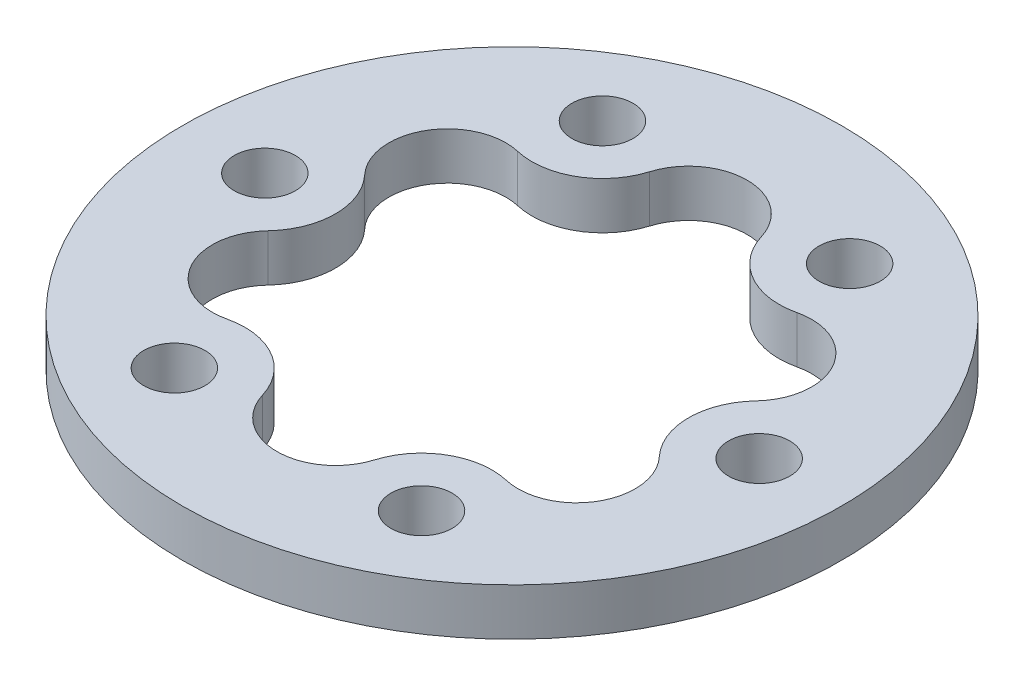
ISO-10303-21;
HEADER;
FILE_DESCRIPTION(('STEP AP214'),'2;1');
FILE_NAME('part.step','',(''),(''),'','','');
FILE_SCHEMA(('AUTOMOTIVE_DESIGN { 1 0 10303 214 1 1 1 1 }'));
ENDSEC;
DATA;
#1=APPLICATION_CONTEXT('core data for automotive mechanical design processes');
#2=APPLICATION_PROTOCOL_DEFINITION('international standard','automotive_design',2000,#1);
#3=PRODUCT_CONTEXT('',#1,'mechanical');
#4=PRODUCT('Part','Part','',(#3));
#5=PRODUCT_RELATED_PRODUCT_CATEGORY('part','',(#4));
#6=PRODUCT_DEFINITION_FORMATION('','',#4);
#7=PRODUCT_DEFINITION_CONTEXT('part definition',#1,'design');
#8=PRODUCT_DEFINITION('design','',#6,#7);
#9=PRODUCT_DEFINITION_SHAPE('','',#8);
#10=(LENGTH_UNIT() NAMED_UNIT(*) SI_UNIT(.MILLI.,.METRE.));
#11=(NAMED_UNIT(*) PLANE_ANGLE_UNIT() SI_UNIT($,.RADIAN.));
#12=(NAMED_UNIT(*) SI_UNIT($,.STERADIAN.) SOLID_ANGLE_UNIT());
#13=UNCERTAINTY_MEASURE_WITH_UNIT(LENGTH_MEASURE(1.E-05),#10,'distance_accuracy_value','');
#14=(GEOMETRIC_REPRESENTATION_CONTEXT(3) GLOBAL_UNCERTAINTY_ASSIGNED_CONTEXT((#13)) GLOBAL_UNIT_ASSIGNED_CONTEXT((#10,
#11,#12)) REPRESENTATION_CONTEXT('',''));
#15=CARTESIAN_POINT('',(0.,0.,0.));
#16=DIRECTION('',(0.,0.,1.));
#17=DIRECTION('',(1.,0.,0.));
#18=AXIS2_PLACEMENT_3D('',#15,#16,#17);
#19=CARTESIAN_POINT('',(0.,4.,0.));
#20=DIRECTION('',(0.,1.,0.));
#21=DIRECTION('',(0.,0.,-1.));
#22=AXIS2_PLACEMENT_3D('',#19,#20,#21);
#23=PLANE('',#22);
#24=CARTESIAN_POINT('',(-10.5000000000001,4.,18.1865334794733));
#25=DIRECTION('',(0.,-1.,0.));
#26=DIRECTION('',(0.,0.,-1.));
#27=AXIS2_PLACEMENT_3D('',#24,#25,#26);
#28=CIRCLE('',#27,2.6);
#29=CARTESIAN_POINT('',(-10.5000000000001,4.,15.5865334794733));
#30=VERTEX_POINT('',#29);
#31=EDGE_CURVE('E227',#30,#30,#28,.T.);
#32=ORIENTED_EDGE('',*,*,#31,.T.);
#33=EDGE_LOOP('',(#32));
#34=FACE_BOUND('',#33,.T.);
#35=CARTESIAN_POINT('',(-10.5000000000001,4.,-18.1865334794731));
#36=DIRECTION('',(0.,-1.,0.));
#37=DIRECTION('',(0.,0.,-1.));
#38=AXIS2_PLACEMENT_3D('',#35,#36,#37);
#39=CIRCLE('',#38,2.6);
#40=CARTESIAN_POINT('',(-10.5000000000001,4.,-20.7865334794731));
#41=VERTEX_POINT('',#40);
#42=EDGE_CURVE('E239',#41,#41,#39,.T.);
#43=ORIENTED_EDGE('',*,*,#42,.T.);
#44=EDGE_LOOP('',(#43));
#45=FACE_BOUND('',#44,.T.);
#46=CARTESIAN_POINT('',(20.9999999999999,4.,0.));
#47=DIRECTION('',(0.,-1.,0.));
#48=DIRECTION('',(0.,0.,-1.));
#49=AXIS2_PLACEMENT_3D('',#46,#47,#48);
#50=CIRCLE('',#49,2.6);
#51=CARTESIAN_POINT('',(20.9999999999999,4.,-2.59999999999992));
#52=VERTEX_POINT('',#51);
#53=EDGE_CURVE('E251',#52,#52,#50,.T.);
#54=ORIENTED_EDGE('',*,*,#53,.T.);
#55=EDGE_LOOP('',(#54));
#56=FACE_BOUND('',#55,.T.);
#57=CARTESIAN_POINT('',(0.,4.,0.));
#58=DIRECTION('',(0.,-1.,0.));
#59=DIRECTION('',(0.,0.,-1.));
#60=AXIS2_PLACEMENT_3D('',#57,#58,#59);
#61=CIRCLE('',#60,28.);
#62=CARTESIAN_POINT('',(0.,4.,-28.));
#63=VERTEX_POINT('',#62);
#64=EDGE_CURVE('E11',#63,#63,#61,.T.);
#65=ORIENTED_EDGE('',*,*,#64,.F.);
#66=EDGE_LOOP('',(#65));
#67=FACE_BOUND('',#66,.T.);
#68=CARTESIAN_POINT('',(10.4999999999999,4.,18.1865334794733));
#69=DIRECTION('',(0.,-1.,0.));
#70=DIRECTION('',(0.,0.,-1.));
#71=AXIS2_PLACEMENT_3D('',#68,#69,#70);
#72=CIRCLE('',#71,2.6);
#73=CARTESIAN_POINT('',(10.4999999999999,4.,15.5865334794733));
#74=VERTEX_POINT('',#73);
#75=EDGE_CURVE('E257',#74,#74,#72,.T.);
#76=ORIENTED_EDGE('',*,*,#75,.T.);
#77=EDGE_LOOP('',(#76));
#78=FACE_BOUND('',#77,.T.);
#79=CARTESIAN_POINT('',(10.4999999999999,4.,-18.1865334794731));
#80=DIRECTION('',(0.,-1.,0.));
#81=DIRECTION('',(0.,0.,-1.));
#82=AXIS2_PLACEMENT_3D('',#79,#80,#81);
#83=CIRCLE('',#82,2.6);
#84=CARTESIAN_POINT('',(10.4999999999999,4.,-20.7865334794731));
#85=VERTEX_POINT('',#84);
#86=EDGE_CURVE('E245',#85,#85,#83,.T.);
#87=ORIENTED_EDGE('',*,*,#86,.T.);
#88=EDGE_LOOP('',(#87));
#89=FACE_BOUND('',#88,.T.);
#90=CARTESIAN_POINT('',(-21.,4.,-1.2805208282618E-13));
#91=DIRECTION('',(0.,-1.,0.));
#92=DIRECTION('',(0.,0.,-1.));
#93=AXIS2_PLACEMENT_3D('',#90,#91,#92);
#94=CIRCLE('',#93,2.6);
#95=CARTESIAN_POINT('',(-21.,4.,-2.60000000000013));
#96=VERTEX_POINT('',#95);
#97=EDGE_CURVE('E233',#96,#96,#94,.T.);
#98=ORIENTED_EDGE('',*,*,#97,.T.);
#99=EDGE_LOOP('',(#98));
#100=FACE_BOUND('',#99,.T.);
#101=CARTESIAN_POINT('',(0.,4.,15.));
#102=DIRECTION('',(0.,-1.,0.));
#103=DIRECTION('',(0.,0.,-1.));
#104=AXIS2_PLACEMENT_3D('',#101,#102,#103);
#105=CIRCLE('',#104,4.97287544884218);
#106=CARTESIAN_POINT('',(4.75856966173356,4.,16.444127765859));
#107=VERTEX_POINT('',#106);
#108=CARTESIAN_POINT('',(-4.75856979574159,4.,16.4441273242872));
#109=VERTEX_POINT('',#108);
#110=EDGE_CURVE('E224',#107,#109,#105,.T.);
#111=ORIENTED_EDGE('',*,*,#110,.T.);
#112=CARTESIAN_POINT('',(-10.4999999999999,4.,18.1865334794733));
#113=DIRECTION('',(0.,-1.,0.));
#114=DIRECTION('',(0.,0.,-1.));
#115=AXIS2_PLACEMENT_3D('',#112,#113,#114);
#116=CIRCLE('',#115,5.99999999999997);
#117=CARTESIAN_POINT('',(-11.8617475574442,4.,12.343106095669));
#118=VERTEX_POINT('',#117);
#119=EDGE_CURVE('E130',#109,#118,#116,.F.);
#120=ORIENTED_EDGE('',*,*,#119,.T.);
#121=CARTESIAN_POINT('',(-12.9903810567665,4.,7.50000000000015));
#122=DIRECTION('',(0.,-1.,0.));
#123=DIRECTION('',(0.,0.,-1.));
#124=AXIS2_PLACEMENT_3D('',#121,#122,#123);
#125=CIRCLE('',#124,4.97287544884219);
#126=CARTESIAN_POINT('',(-16.6203169037695,4.,4.10102133335012));
#127=VERTEX_POINT('',#126);
#128=EDGE_CURVE('E194',#118,#127,#125,.T.);
#129=ORIENTED_EDGE('',*,*,#128,.T.);
#130=CARTESIAN_POINT('',(-21.,4.,0.));
#131=DIRECTION('',(0.,-1.,0.));
#132=DIRECTION('',(0.,0.,-1.));
#133=AXIS2_PLACEMENT_3D('',#130,#131,#132);
#134=CIRCLE('',#133,5.99999999999997);
#135=CARTESIAN_POINT('',(-16.6203172191779,4.,-4.10102167019011));
#136=VERTEX_POINT('',#135);
#137=EDGE_CURVE('E197',#127,#136,#134,.F.);
#138=ORIENTED_EDGE('',*,*,#137,.T.);
#139=CARTESIAN_POINT('',(-12.9903810567667,4.,-7.49999999999988));
#140=DIRECTION('',(0.,-1.,0.));
#141=DIRECTION('',(0.,0.,-1.));
#142=AXIS2_PLACEMENT_3D('',#139,#140,#141);
#143=CIRCLE('',#142,4.97287544884218);
#144=CARTESIAN_POINT('',(-11.8617471080278,4.,-12.3431059909372));
#145=VERTEX_POINT('',#144);
#146=EDGE_CURVE('E200',#136,#145,#143,.T.);
#147=ORIENTED_EDGE('',*,*,#146,.T.);
#148=CARTESIAN_POINT('',(-10.5,4.,-18.1865334794732));
#149=DIRECTION('',(0.,-1.,0.));
#150=DIRECTION('',(0.,0.,-1.));
#151=AXIS2_PLACEMENT_3D('',#148,#149,#150);
#152=CIRCLE('',#151,6.00000000000005);
#153=CARTESIAN_POINT('',(-4.75856966173379,4.,-16.4441277658589));
#154=VERTEX_POINT('',#153);
#155=EDGE_CURVE('E203',#145,#154,#152,.F.);
#156=ORIENTED_EDGE('',*,*,#155,.T.);
#157=CARTESIAN_POINT('',(-1.04517089427603E-13,4.,-15.));
#158=DIRECTION('',(0.,-1.,0.));
#159=DIRECTION('',(0.,0.,-1.));
#160=AXIS2_PLACEMENT_3D('',#157,#158,#159);
#161=CIRCLE('',#160,4.97287544884213);
#162=CARTESIAN_POINT('',(4.75856979574155,4.,-16.4441273242872));
#163=VERTEX_POINT('',#162);
#164=EDGE_CURVE('E206',#154,#163,#161,.T.);
#165=ORIENTED_EDGE('',*,*,#164,.T.);
#166=CARTESIAN_POINT('',(10.5,4.,-18.1865334794732));
#167=DIRECTION('',(0.,-1.,0.));
#168=DIRECTION('',(0.,0.,-1.));
#169=AXIS2_PLACEMENT_3D('',#166,#167,#168);
#170=CIRCLE('',#169,6.00000000000014);
#171=CARTESIAN_POINT('',(11.8617475574439,4.,-12.3431060956688));
#172=VERTEX_POINT('',#171);
#173=EDGE_CURVE('E209',#163,#172,#170,.F.);
#174=ORIENTED_EDGE('',*,*,#173,.T.);
#175=CARTESIAN_POINT('',(12.9903810567665,4.,-7.50000000000006));
#176=DIRECTION('',(0.,-1.,0.));
#177=DIRECTION('',(0.,0.,-1.));
#178=AXIS2_PLACEMENT_3D('',#175,#176,#177);
#179=CIRCLE('',#178,4.97287544884212);
#180=CARTESIAN_POINT('',(16.6203169037692,4.,-4.10102133334997));
#181=VERTEX_POINT('',#180);
#182=EDGE_CURVE('E212',#172,#181,#179,.T.);
#183=ORIENTED_EDGE('',*,*,#182,.T.);
#184=CARTESIAN_POINT('',(21.,4.,0.));
#185=DIRECTION('',(0.,-1.,0.));
#186=DIRECTION('',(0.,0.,-1.));
#187=AXIS2_PLACEMENT_3D('',#184,#185,#186);
#188=CIRCLE('',#187,6.00000000000014);
#189=CARTESIAN_POINT('',(16.6203172191777,4.,4.10102167019016));
#190=VERTEX_POINT('',#189);
#191=EDGE_CURVE('E215',#181,#190,#188,.F.);
#192=ORIENTED_EDGE('',*,*,#191,.T.);
#193=CARTESIAN_POINT('',(12.9903810567666,4.,7.49999999999997));
#194=DIRECTION('',(0.,-1.,0.));
#195=DIRECTION('',(0.,0.,-1.));
#196=AXIS2_PLACEMENT_3D('',#193,#194,#195);
#197=CIRCLE('',#196,4.97287544884214);
#198=CARTESIAN_POINT('',(11.8617471080276,4.,12.3431059909372));
#199=VERTEX_POINT('',#198);
#200=EDGE_CURVE('E218',#190,#199,#197,.T.);
#201=ORIENTED_EDGE('',*,*,#200,.T.);
#202=CARTESIAN_POINT('',(10.4999999999999,4.,18.1865334794733));
#203=DIRECTION('',(0.,-1.,0.));
#204=DIRECTION('',(0.,0.,-1.));
#205=AXIS2_PLACEMENT_3D('',#202,#203,#204);
#206=CIRCLE('',#205,6.00000000000005);
#207=EDGE_CURVE('E221',#199,#107,#206,.F.);
#208=ORIENTED_EDGE('',*,*,#207,.T.);
#209=EDGE_LOOP('',(#111,#120,#129,#138,#147,#156,#165,#174,#183,#192,#201,#208));
#210=FACE_BOUND('',#209,.T.);
#211=ADVANCED_FACE('F36',(#34,#45,#56,#67,#78,#89,#100,#210),#23,.T.);
#212=CARTESIAN_POINT('',(0.,0.,0.));
#213=DIRECTION('',(0.,1.,0.));
#214=DIRECTION('',(0.,0.,-1.));
#215=AXIS2_PLACEMENT_3D('',#212,#213,#214);
#216=PLANE('',#215);
#217=CARTESIAN_POINT('',(0.,0.,0.));
#218=DIRECTION('',(0.,-1.,0.));
#219=DIRECTION('',(0.,0.,-1.));
#220=AXIS2_PLACEMENT_3D('',#217,#218,#219);
#221=CIRCLE('',#220,28.);
#222=CARTESIAN_POINT('',(0.,0.,-28.));
#223=VERTEX_POINT('',#222);
#224=EDGE_CURVE('E40',#223,#223,#221,.T.);
#225=ORIENTED_EDGE('',*,*,#224,.T.);
#226=EDGE_LOOP('',(#225));
#227=FACE_BOUND('',#226,.T.);
#228=CARTESIAN_POINT('',(10.4999999999999,0.,18.1865334794733));
#229=DIRECTION('',(0.,-1.,0.));
#230=DIRECTION('',(0.,0.,-1.));
#231=AXIS2_PLACEMENT_3D('',#228,#229,#230);
#232=CIRCLE('',#231,2.6);
#233=CARTESIAN_POINT('',(10.4999999999999,0.,15.5865334794733));
#234=VERTEX_POINT('',#233);
#235=EDGE_CURVE('E254',#234,#234,#232,.T.);
#236=ORIENTED_EDGE('',*,*,#235,.F.);
#237=EDGE_LOOP('',(#236));
#238=FACE_BOUND('',#237,.T.);
#239=CARTESIAN_POINT('',(20.9999999999999,0.,0.));
#240=DIRECTION('',(0.,-1.,0.));
#241=DIRECTION('',(0.,0.,-1.));
#242=AXIS2_PLACEMENT_3D('',#239,#240,#241);
#243=CIRCLE('',#242,2.6);
#244=CARTESIAN_POINT('',(20.9999999999999,0.,-2.59999999999992));
#245=VERTEX_POINT('',#244);
#246=EDGE_CURVE('E248',#245,#245,#243,.T.);
#247=ORIENTED_EDGE('',*,*,#246,.F.);
#248=EDGE_LOOP('',(#247));
#249=FACE_BOUND('',#248,.T.);
#250=CARTESIAN_POINT('',(10.4999999999999,0.,-18.1865334794731));
#251=DIRECTION('',(0.,-1.,0.));
#252=DIRECTION('',(0.,0.,-1.));
#253=AXIS2_PLACEMENT_3D('',#250,#251,#252);
#254=CIRCLE('',#253,2.6);
#255=CARTESIAN_POINT('',(10.4999999999999,0.,-20.7865334794731));
#256=VERTEX_POINT('',#255);
#257=EDGE_CURVE('E242',#256,#256,#254,.T.);
#258=ORIENTED_EDGE('',*,*,#257,.F.);
#259=EDGE_LOOP('',(#258));
#260=FACE_BOUND('',#259,.T.);
#261=CARTESIAN_POINT('',(-10.5000000000001,0.,-18.1865334794731));
#262=DIRECTION('',(0.,-1.,0.));
#263=DIRECTION('',(0.,0.,-1.));
#264=AXIS2_PLACEMENT_3D('',#261,#262,#263);
#265=CIRCLE('',#264,2.6);
#266=CARTESIAN_POINT('',(-10.5000000000001,0.,-20.7865334794731));
#267=VERTEX_POINT('',#266);
#268=EDGE_CURVE('E236',#267,#267,#265,.T.);
#269=ORIENTED_EDGE('',*,*,#268,.F.);
#270=EDGE_LOOP('',(#269));
#271=FACE_BOUND('',#270,.T.);
#272=CARTESIAN_POINT('',(-21.,0.,-1.2805208282618E-13));
#273=DIRECTION('',(0.,-1.,0.));
#274=DIRECTION('',(0.,0.,-1.));
#275=AXIS2_PLACEMENT_3D('',#272,#273,#274);
#276=CIRCLE('',#275,2.6);
#277=CARTESIAN_POINT('',(-21.,0.,-2.60000000000013));
#278=VERTEX_POINT('',#277);
#279=EDGE_CURVE('E230',#278,#278,#276,.T.);
#280=ORIENTED_EDGE('',*,*,#279,.F.);
#281=EDGE_LOOP('',(#280));
#282=FACE_BOUND('',#281,.T.);
#283=CARTESIAN_POINT('',(-10.5000000000001,0.,18.1865334794733));
#284=DIRECTION('',(0.,-1.,0.));
#285=DIRECTION('',(0.,0.,-1.));
#286=AXIS2_PLACEMENT_3D('',#283,#284,#285);
#287=CIRCLE('',#286,2.6);
#288=CARTESIAN_POINT('',(-10.5000000000001,0.,15.5865334794733));
#289=VERTEX_POINT('',#288);
#290=EDGE_CURVE('E226',#289,#289,#287,.T.);
#291=ORIENTED_EDGE('',*,*,#290,.F.);
#292=EDGE_LOOP('',(#291));
#293=FACE_BOUND('',#292,.T.);
#294=CARTESIAN_POINT('',(10.4999999999999,0.,18.1865334794733));
#295=DIRECTION('',(0.,1.,0.));
#296=DIRECTION('',(0.,0.,-1.));
#297=AXIS2_PLACEMENT_3D('',#294,#295,#296);
#298=CIRCLE('',#297,6.00000000000005);
#299=CARTESIAN_POINT('',(11.8617471080276,0.,12.3431059909372));
#300=VERTEX_POINT('',#299);
#301=CARTESIAN_POINT('',(4.75856966173356,0.,16.444127765859));
#302=VERTEX_POINT('',#301);
#303=EDGE_CURVE('E132',#300,#302,#298,.T.);
#304=ORIENTED_EDGE('',*,*,#303,.F.);
#305=CARTESIAN_POINT('',(12.9903810567666,0.,7.49999999999997));
#306=DIRECTION('',(0.,-1.,0.));
#307=DIRECTION('',(0.,0.,1.));
#308=AXIS2_PLACEMENT_3D('',#305,#306,#307);
#309=CIRCLE('',#308,4.97287544884214);
#310=CARTESIAN_POINT('',(16.6203172191777,0.,4.10102167019016));
#311=VERTEX_POINT('',#310);
#312=EDGE_CURVE('E169',#311,#300,#309,.T.);
#313=ORIENTED_EDGE('',*,*,#312,.F.);
#314=CARTESIAN_POINT('',(21.,0.,0.));
#315=DIRECTION('',(0.,1.,0.));
#316=DIRECTION('',(0.,0.,-1.));
#317=AXIS2_PLACEMENT_3D('',#314,#315,#316);
#318=CIRCLE('',#317,6.00000000000014);
#319=CARTESIAN_POINT('',(16.6203169037692,0.,-4.10102133334997));
#320=VERTEX_POINT('',#319);
#321=EDGE_CURVE('E166',#320,#311,#318,.T.);
#322=ORIENTED_EDGE('',*,*,#321,.F.);
#323=CARTESIAN_POINT('',(12.9903810567665,0.,-7.50000000000006));
#324=DIRECTION('',(0.,-1.,0.));
#325=DIRECTION('',(0.,0.,1.));
#326=AXIS2_PLACEMENT_3D('',#323,#324,#325);
#327=CIRCLE('',#326,4.97287544884212);
#328=CARTESIAN_POINT('',(11.8617475574439,0.,-12.3431060956688));
#329=VERTEX_POINT('',#328);
#330=EDGE_CURVE('E163',#329,#320,#327,.T.);
#331=ORIENTED_EDGE('',*,*,#330,.F.);
#332=CARTESIAN_POINT('',(10.5,0.,-18.1865334794732));
#333=DIRECTION('',(0.,1.,0.));
#334=DIRECTION('',(0.,0.,-1.));
#335=AXIS2_PLACEMENT_3D('',#332,#333,#334);
#336=CIRCLE('',#335,6.00000000000014);
#337=CARTESIAN_POINT('',(4.75856979574155,0.,-16.4441273242872));
#338=VERTEX_POINT('',#337);
#339=EDGE_CURVE('E160',#338,#329,#336,.T.);
#340=ORIENTED_EDGE('',*,*,#339,.F.);
#341=CARTESIAN_POINT('',(-1.04517089427603E-13,0.,-15.));
#342=DIRECTION('',(0.,-1.,0.));
#343=DIRECTION('',(0.,0.,1.));
#344=AXIS2_PLACEMENT_3D('',#341,#342,#343);
#345=CIRCLE('',#344,4.97287544884213);
#346=CARTESIAN_POINT('',(-4.75856966173379,0.,-16.4441277658589));
#347=VERTEX_POINT('',#346);
#348=EDGE_CURVE('E157',#347,#338,#345,.T.);
#349=ORIENTED_EDGE('',*,*,#348,.F.);
#350=CARTESIAN_POINT('',(-10.5,0.,-18.1865334794732));
#351=DIRECTION('',(0.,1.,0.));
#352=DIRECTION('',(0.,0.,-1.));
#353=AXIS2_PLACEMENT_3D('',#350,#351,#352);
#354=CIRCLE('',#353,6.00000000000005);
#355=CARTESIAN_POINT('',(-11.8617471080278,0.,-12.3431059909372));
#356=VERTEX_POINT('',#355);
#357=EDGE_CURVE('E154',#356,#347,#354,.T.);
#358=ORIENTED_EDGE('',*,*,#357,.F.);
#359=CARTESIAN_POINT('',(-12.9903810567667,0.,-7.49999999999988));
#360=DIRECTION('',(0.,-1.,0.));
#361=DIRECTION('',(0.,0.,1.));
#362=AXIS2_PLACEMENT_3D('',#359,#360,#361);
#363=CIRCLE('',#362,4.97287544884218);
#364=CARTESIAN_POINT('',(-16.6203172191779,0.,-4.10102167019011));
#365=VERTEX_POINT('',#364);
#366=EDGE_CURVE('E151',#365,#356,#363,.T.);
#367=ORIENTED_EDGE('',*,*,#366,.F.);
#368=CARTESIAN_POINT('',(-21.,0.,0.));
#369=DIRECTION('',(0.,1.,0.));
#370=DIRECTION('',(0.,0.,-1.));
#371=AXIS2_PLACEMENT_3D('',#368,#369,#370);
#372=CIRCLE('',#371,5.99999999999997);
#373=CARTESIAN_POINT('',(-16.6203169037695,0.,4.10102133335012));
#374=VERTEX_POINT('',#373);
#375=EDGE_CURVE('E146',#374,#365,#372,.T.);
#376=ORIENTED_EDGE('',*,*,#375,.F.);
#377=CARTESIAN_POINT('',(-12.9903810567665,0.,7.50000000000015));
#378=DIRECTION('',(0.,-1.,0.));
#379=DIRECTION('',(0.,0.,1.));
#380=AXIS2_PLACEMENT_3D('',#377,#378,#379);
#381=CIRCLE('',#380,4.97287544884219);
#382=CARTESIAN_POINT('',(-11.8617475574442,0.,12.343106095669));
#383=VERTEX_POINT('',#382);
#384=EDGE_CURVE('E144',#383,#374,#381,.T.);
#385=ORIENTED_EDGE('',*,*,#384,.F.);
#386=CARTESIAN_POINT('',(-10.4999999999999,0.,18.1865334794733));
#387=DIRECTION('',(0.,1.,0.));
#388=DIRECTION('',(0.,0.,-1.));
#389=AXIS2_PLACEMENT_3D('',#386,#387,#388);
#390=CIRCLE('',#389,5.99999999999997);
#391=CARTESIAN_POINT('',(-4.75856979574159,0.,16.4441273242872));
#392=VERTEX_POINT('',#391);
#393=EDGE_CURVE('E127',#392,#383,#390,.T.);
#394=ORIENTED_EDGE('',*,*,#393,.F.);
#395=CARTESIAN_POINT('',(0.,0.,15.));
#396=DIRECTION('',(0.,-1.,0.));
#397=DIRECTION('',(0.,0.,1.));
#398=AXIS2_PLACEMENT_3D('',#395,#396,#397);
#399=CIRCLE('',#398,4.97287544884218);
#400=EDGE_CURVE('E135',#302,#392,#399,.T.);
#401=ORIENTED_EDGE('',*,*,#400,.F.);
#402=EDGE_LOOP('',(#304,#313,#322,#331,#340,#349,#358,#367,#376,#385,#394,#401));
#403=FACE_BOUND('',#402,.T.);
#404=ADVANCED_FACE('F142',(#227,#238,#249,#260,#271,#282,#293,#403),#216,.F.);
#405=CARTESIAN_POINT('',(0.,4.,0.));
#406=DIRECTION('',(0.,-1.,0.));
#407=DIRECTION('',(0.,0.,1.));
#408=AXIS2_PLACEMENT_3D('',#405,#406,#407);
#409=CYLINDRICAL_SURFACE('',#408,28.);
#410=ORIENTED_EDGE('',*,*,#64,.T.);
#411=EDGE_LOOP('',(#410));
#412=FACE_BOUND('',#411,.T.);
#413=ORIENTED_EDGE('',*,*,#224,.F.);
#414=EDGE_LOOP('',(#413));
#415=FACE_BOUND('',#414,.T.);
#416=ADVANCED_FACE('F38',(#412,#415),#409,.T.);
#417=CARTESIAN_POINT('',(10.4999999999999,4.,18.1865334794733));
#418=DIRECTION('',(0.,-1.,0.));
#419=DIRECTION('',(0.,0.,1.));
#420=AXIS2_PLACEMENT_3D('',#417,#418,#419);
#421=CYLINDRICAL_SURFACE('',#420,2.6);
#422=ORIENTED_EDGE('',*,*,#75,.F.);
#423=EDGE_LOOP('',(#422));
#424=FACE_BOUND('',#423,.T.);
#425=ORIENTED_EDGE('',*,*,#235,.T.);
#426=EDGE_LOOP('',(#425));
#427=FACE_BOUND('',#426,.T.);
#428=ADVANCED_FACE('F263',(#424,#427),#421,.F.);
#429=CARTESIAN_POINT('',(20.9999999999999,4.,0.));
#430=DIRECTION('',(0.,-1.,0.));
#431=DIRECTION('',(0.,0.,1.));
#432=AXIS2_PLACEMENT_3D('',#429,#430,#431);
#433=CYLINDRICAL_SURFACE('',#432,2.6);
#434=ORIENTED_EDGE('',*,*,#53,.F.);
#435=EDGE_LOOP('',(#434));
#436=FACE_BOUND('',#435,.T.);
#437=ORIENTED_EDGE('',*,*,#246,.T.);
#438=EDGE_LOOP('',(#437));
#439=FACE_BOUND('',#438,.T.);
#440=ADVANCED_FACE('F302',(#436,#439),#433,.F.);
#441=CARTESIAN_POINT('',(10.4999999999999,4.,-18.1865334794731));
#442=DIRECTION('',(0.,-1.,0.));
#443=DIRECTION('',(0.,0.,1.));
#444=AXIS2_PLACEMENT_3D('',#441,#442,#443);
#445=CYLINDRICAL_SURFACE('',#444,2.6);
#446=ORIENTED_EDGE('',*,*,#86,.F.);
#447=EDGE_LOOP('',(#446));
#448=FACE_BOUND('',#447,.T.);
#449=ORIENTED_EDGE('',*,*,#257,.T.);
#450=EDGE_LOOP('',(#449));
#451=FACE_BOUND('',#450,.T.);
#452=ADVANCED_FACE('F306',(#448,#451),#445,.F.);
#453=CARTESIAN_POINT('',(-10.5000000000001,4.,-18.1865334794731));
#454=DIRECTION('',(0.,-1.,0.));
#455=DIRECTION('',(0.,0.,1.));
#456=AXIS2_PLACEMENT_3D('',#453,#454,#455);
#457=CYLINDRICAL_SURFACE('',#456,2.6);
#458=ORIENTED_EDGE('',*,*,#42,.F.);
#459=EDGE_LOOP('',(#458));
#460=FACE_BOUND('',#459,.T.);
#461=ORIENTED_EDGE('',*,*,#268,.T.);
#462=EDGE_LOOP('',(#461));
#463=FACE_BOUND('',#462,.T.);
#464=ADVANCED_FACE('F289',(#460,#463),#457,.F.);
#465=CARTESIAN_POINT('',(-21.,4.,-1.2805208282618E-13));
#466=DIRECTION('',(0.,-1.,0.));
#467=DIRECTION('',(0.,0.,1.));
#468=AXIS2_PLACEMENT_3D('',#465,#466,#467);
#469=CYLINDRICAL_SURFACE('',#468,2.6);
#470=ORIENTED_EDGE('',*,*,#97,.F.);
#471=EDGE_LOOP('',(#470));
#472=FACE_BOUND('',#471,.T.);
#473=ORIENTED_EDGE('',*,*,#279,.T.);
#474=EDGE_LOOP('',(#473));
#475=FACE_BOUND('',#474,.T.);
#476=ADVANCED_FACE('F280',(#472,#475),#469,.F.);
#477=CARTESIAN_POINT('',(-10.5000000000001,4.,18.1865334794733));
#478=DIRECTION('',(0.,-1.,0.));
#479=DIRECTION('',(0.,0.,1.));
#480=AXIS2_PLACEMENT_3D('',#477,#478,#479);
#481=CYLINDRICAL_SURFACE('',#480,2.6);
#482=ORIENTED_EDGE('',*,*,#31,.F.);
#483=EDGE_LOOP('',(#482));
#484=FACE_BOUND('',#483,.T.);
#485=ORIENTED_EDGE('',*,*,#290,.T.);
#486=EDGE_LOOP('',(#485));
#487=FACE_BOUND('',#486,.T.);
#488=ADVANCED_FACE('F278',(#484,#487),#481,.F.);
#489=CARTESIAN_POINT('',(0.,0.,15.));
#490=DIRECTION('',(0.,1.,0.));
#491=DIRECTION('',(0.,0.,-1.));
#492=AXIS2_PLACEMENT_3D('',#489,#490,#491);
#493=CYLINDRICAL_SURFACE('',#492,4.97287544884218);
#494=ORIENTED_EDGE('',*,*,#110,.F.);
#495=DIRECTION('',(0.,1.,0.));
#496=VECTOR('',#495,1.);
#497=CARTESIAN_POINT('',(4.75856966173356,0.,16.444127765859));
#498=LINE('',#497,#496);
#499=EDGE_CURVE('E137',#302,#107,#498,.T.);
#500=ORIENTED_EDGE('',*,*,#499,.F.);
#501=ORIENTED_EDGE('',*,*,#400,.T.);
#502=DIRECTION('',(0.,1.,0.));
#503=VECTOR('',#502,1.);
#504=CARTESIAN_POINT('',(-4.75856979574159,0.,16.4441273242872));
#505=LINE('',#504,#503);
#506=EDGE_CURVE('E51',#392,#109,#505,.T.);
#507=ORIENTED_EDGE('',*,*,#506,.T.);
#508=EDGE_LOOP('',(#494,#500,#501,#507));
#509=FACE_BOUND('',#508,.T.);
#510=ADVANCED_FACE('F136',(#509),#493,.F.);
#511=CARTESIAN_POINT('',(10.4999999999999,0.,18.1865334794733));
#512=DIRECTION('',(0.,1.,0.));
#513=DIRECTION('',(0.,0.,-1.));
#514=AXIS2_PLACEMENT_3D('',#511,#512,#513);
#515=CYLINDRICAL_SURFACE('',#514,6.00000000000005);
#516=ORIENTED_EDGE('',*,*,#207,.F.);
#517=DIRECTION('',(0.,1.,0.));
#518=VECTOR('',#517,1.);
#519=CARTESIAN_POINT('',(11.8617471080276,0.,12.3431059909372));
#520=LINE('',#519,#518);
#521=EDGE_CURVE('E174',#300,#199,#520,.T.);
#522=ORIENTED_EDGE('',*,*,#521,.F.);
#523=ORIENTED_EDGE('',*,*,#303,.T.);
#524=ORIENTED_EDGE('',*,*,#499,.T.);
#525=EDGE_LOOP('',(#516,#522,#523,#524));
#526=FACE_BOUND('',#525,.T.);
#527=ADVANCED_FACE('F287',(#526),#515,.T.);
#528=CARTESIAN_POINT('',(12.9903810567666,0.,7.49999999999997));
#529=DIRECTION('',(0.,1.,0.));
#530=DIRECTION('',(0.,0.,-1.));
#531=AXIS2_PLACEMENT_3D('',#528,#529,#530);
#532=CYLINDRICAL_SURFACE('',#531,4.97287544884214);
#533=ORIENTED_EDGE('',*,*,#200,.F.);
#534=DIRECTION('',(0.,1.,0.));
#535=VECTOR('',#534,1.);
#536=CARTESIAN_POINT('',(16.6203172191777,0.,4.10102167019016));
#537=LINE('',#536,#535);
#538=EDGE_CURVE('E176',#311,#190,#537,.T.);
#539=ORIENTED_EDGE('',*,*,#538,.F.);
#540=ORIENTED_EDGE('',*,*,#312,.T.);
#541=ORIENTED_EDGE('',*,*,#521,.T.);
#542=EDGE_LOOP('',(#533,#539,#540,#541));
#543=FACE_BOUND('',#542,.T.);
#544=ADVANCED_FACE('F335',(#543),#532,.F.);
#545=CARTESIAN_POINT('',(21.,0.,0.));
#546=DIRECTION('',(0.,1.,0.));
#547=DIRECTION('',(0.,0.,-1.));
#548=AXIS2_PLACEMENT_3D('',#545,#546,#547);
#549=CYLINDRICAL_SURFACE('',#548,6.00000000000014);
#550=ORIENTED_EDGE('',*,*,#191,.F.);
#551=DIRECTION('',(0.,1.,0.));
#552=VECTOR('',#551,1.);
#553=CARTESIAN_POINT('',(16.6203169037692,0.,-4.10102133334997));
#554=LINE('',#553,#552);
#555=EDGE_CURVE('E178',#320,#181,#554,.T.);
#556=ORIENTED_EDGE('',*,*,#555,.F.);
#557=ORIENTED_EDGE('',*,*,#321,.T.);
#558=ORIENTED_EDGE('',*,*,#538,.T.);
#559=EDGE_LOOP('',(#550,#556,#557,#558));
#560=FACE_BOUND('',#559,.T.);
#561=ADVANCED_FACE('F338',(#560),#549,.T.);
#562=CARTESIAN_POINT('',(12.9903810567665,0.,-7.50000000000006));
#563=DIRECTION('',(0.,1.,0.));
#564=DIRECTION('',(0.,0.,-1.));
#565=AXIS2_PLACEMENT_3D('',#562,#563,#564);
#566=CYLINDRICAL_SURFACE('',#565,4.97287544884212);
#567=ORIENTED_EDGE('',*,*,#182,.F.);
#568=DIRECTION('',(0.,1.,0.));
#569=VECTOR('',#568,1.);
#570=CARTESIAN_POINT('',(11.8617475574439,0.,-12.3431060956688));
#571=LINE('',#570,#569);
#572=EDGE_CURVE('E180',#329,#172,#571,.T.);
#573=ORIENTED_EDGE('',*,*,#572,.F.);
#574=ORIENTED_EDGE('',*,*,#330,.T.);
#575=ORIENTED_EDGE('',*,*,#555,.T.);
#576=EDGE_LOOP('',(#567,#573,#574,#575));
#577=FACE_BOUND('',#576,.T.);
#578=ADVANCED_FACE('F341',(#577),#566,.F.);
#579=CARTESIAN_POINT('',(10.5,0.,-18.1865334794732));
#580=DIRECTION('',(0.,1.,0.));
#581=DIRECTION('',(0.,0.,-1.));
#582=AXIS2_PLACEMENT_3D('',#579,#580,#581);
#583=CYLINDRICAL_SURFACE('',#582,6.00000000000014);
#584=ORIENTED_EDGE('',*,*,#173,.F.);
#585=DIRECTION('',(0.,1.,0.));
#586=VECTOR('',#585,1.);
#587=CARTESIAN_POINT('',(4.75856979574155,0.,-16.4441273242872));
#588=LINE('',#587,#586);
#589=EDGE_CURVE('E182',#338,#163,#588,.T.);
#590=ORIENTED_EDGE('',*,*,#589,.F.);
#591=ORIENTED_EDGE('',*,*,#339,.T.);
#592=ORIENTED_EDGE('',*,*,#572,.T.);
#593=EDGE_LOOP('',(#584,#590,#591,#592));
#594=FACE_BOUND('',#593,.T.);
#595=ADVANCED_FACE('F347',(#594),#583,.T.);
#596=CARTESIAN_POINT('',(-1.04517089427603E-13,0.,-15.));
#597=DIRECTION('',(0.,1.,0.));
#598=DIRECTION('',(0.,0.,-1.));
#599=AXIS2_PLACEMENT_3D('',#596,#597,#598);
#600=CYLINDRICAL_SURFACE('',#599,4.97287544884213);
#601=ORIENTED_EDGE('',*,*,#164,.F.);
#602=DIRECTION('',(0.,1.,0.));
#603=VECTOR('',#602,1.);
#604=CARTESIAN_POINT('',(-4.75856966173379,0.,-16.4441277658589));
#605=LINE('',#604,#603);
#606=EDGE_CURVE('E184',#347,#154,#605,.T.);
#607=ORIENTED_EDGE('',*,*,#606,.F.);
#608=ORIENTED_EDGE('',*,*,#348,.T.);
#609=ORIENTED_EDGE('',*,*,#589,.T.);
#610=EDGE_LOOP('',(#601,#607,#608,#609));
#611=FACE_BOUND('',#610,.T.);
#612=ADVANCED_FACE('F350',(#611),#600,.F.);
#613=CARTESIAN_POINT('',(-10.5,0.,-18.1865334794732));
#614=DIRECTION('',(0.,1.,0.));
#615=DIRECTION('',(0.,0.,-1.));
#616=AXIS2_PLACEMENT_3D('',#613,#614,#615);
#617=CYLINDRICAL_SURFACE('',#616,6.00000000000005);
#618=ORIENTED_EDGE('',*,*,#155,.F.);
#619=DIRECTION('',(0.,1.,0.));
#620=VECTOR('',#619,1.);
#621=CARTESIAN_POINT('',(-11.8617471080278,0.,-12.3431059909372));
#622=LINE('',#621,#620);
#623=EDGE_CURVE('E186',#356,#145,#622,.T.);
#624=ORIENTED_EDGE('',*,*,#623,.F.);
#625=ORIENTED_EDGE('',*,*,#357,.T.);
#626=ORIENTED_EDGE('',*,*,#606,.T.);
#627=EDGE_LOOP('',(#618,#624,#625,#626));
#628=FACE_BOUND('',#627,.T.);
#629=ADVANCED_FACE('F353',(#628),#617,.T.);
#630=CARTESIAN_POINT('',(-12.9903810567667,0.,-7.49999999999988));
#631=DIRECTION('',(0.,1.,0.));
#632=DIRECTION('',(0.,0.,-1.));
#633=AXIS2_PLACEMENT_3D('',#630,#631,#632);
#634=CYLINDRICAL_SURFACE('',#633,4.97287544884218);
#635=ORIENTED_EDGE('',*,*,#146,.F.);
#636=DIRECTION('',(0.,1.,0.));
#637=VECTOR('',#636,1.);
#638=CARTESIAN_POINT('',(-16.6203172191779,0.,-4.10102167019011));
#639=LINE('',#638,#637);
#640=EDGE_CURVE('E188',#365,#136,#639,.T.);
#641=ORIENTED_EDGE('',*,*,#640,.F.);
#642=ORIENTED_EDGE('',*,*,#366,.T.);
#643=ORIENTED_EDGE('',*,*,#623,.T.);
#644=EDGE_LOOP('',(#635,#641,#642,#643));
#645=FACE_BOUND('',#644,.T.);
#646=ADVANCED_FACE('F357',(#645),#634,.F.);
#647=CARTESIAN_POINT('',(-21.,0.,0.));
#648=DIRECTION('',(0.,1.,0.));
#649=DIRECTION('',(0.,0.,-1.));
#650=AXIS2_PLACEMENT_3D('',#647,#648,#649);
#651=CYLINDRICAL_SURFACE('',#650,5.99999999999997);
#652=ORIENTED_EDGE('',*,*,#137,.F.);
#653=DIRECTION('',(0.,1.,0.));
#654=VECTOR('',#653,1.);
#655=CARTESIAN_POINT('',(-16.6203169037695,0.,4.10102133335012));
#656=LINE('',#655,#654);
#657=EDGE_CURVE('E190',#374,#127,#656,.T.);
#658=ORIENTED_EDGE('',*,*,#657,.F.);
#659=ORIENTED_EDGE('',*,*,#375,.T.);
#660=ORIENTED_EDGE('',*,*,#640,.T.);
#661=EDGE_LOOP('',(#652,#658,#659,#660));
#662=FACE_BOUND('',#661,.T.);
#663=ADVANCED_FACE('F360',(#662),#651,.T.);
#664=CARTESIAN_POINT('',(-12.9903810567665,0.,7.50000000000015));
#665=DIRECTION('',(0.,1.,0.));
#666=DIRECTION('',(0.,0.,-1.));
#667=AXIS2_PLACEMENT_3D('',#664,#665,#666);
#668=CYLINDRICAL_SURFACE('',#667,4.97287544884219);
#669=ORIENTED_EDGE('',*,*,#128,.F.);
#670=DIRECTION('',(0.,1.,0.));
#671=VECTOR('',#670,1.);
#672=CARTESIAN_POINT('',(-11.8617475574442,0.,12.343106095669));
#673=LINE('',#672,#671);
#674=EDGE_CURVE('E59',#383,#118,#673,.T.);
#675=ORIENTED_EDGE('',*,*,#674,.F.);
#676=ORIENTED_EDGE('',*,*,#384,.T.);
#677=ORIENTED_EDGE('',*,*,#657,.T.);
#678=EDGE_LOOP('',(#669,#675,#676,#677));
#679=FACE_BOUND('',#678,.T.);
#680=ADVANCED_FACE('F361',(#679),#668,.F.);
#681=CARTESIAN_POINT('',(-10.4999999999999,0.,18.1865334794733));
#682=DIRECTION('',(0.,1.,0.));
#683=DIRECTION('',(0.,0.,-1.));
#684=AXIS2_PLACEMENT_3D('',#681,#682,#683);
#685=CYLINDRICAL_SURFACE('',#684,5.99999999999997);
#686=ORIENTED_EDGE('',*,*,#119,.F.);
#687=ORIENTED_EDGE('',*,*,#506,.F.);
#688=ORIENTED_EDGE('',*,*,#393,.T.);
#689=ORIENTED_EDGE('',*,*,#674,.T.);
#690=EDGE_LOOP('',(#686,#687,#688,#689));
#691=FACE_BOUND('',#690,.T.);
#692=ADVANCED_FACE('F125',(#691),#685,.T.);
#693=CLOSED_SHELL('',(#211,#404,#416,#428,#440,#452,#464,#476,#488,#510,#527,#544,#561,#578,
#595,#612,#629,#646,#663,#680,#692));
#694=MANIFOLD_SOLID_BREP('B2',#693);
#695=ADVANCED_BREP_SHAPE_REPRESENTATION('',(#18,#694),#14);
#696=SHAPE_DEFINITION_REPRESENTATION(#9,#695);
ENDSEC;
END-ISO-10303-21;
